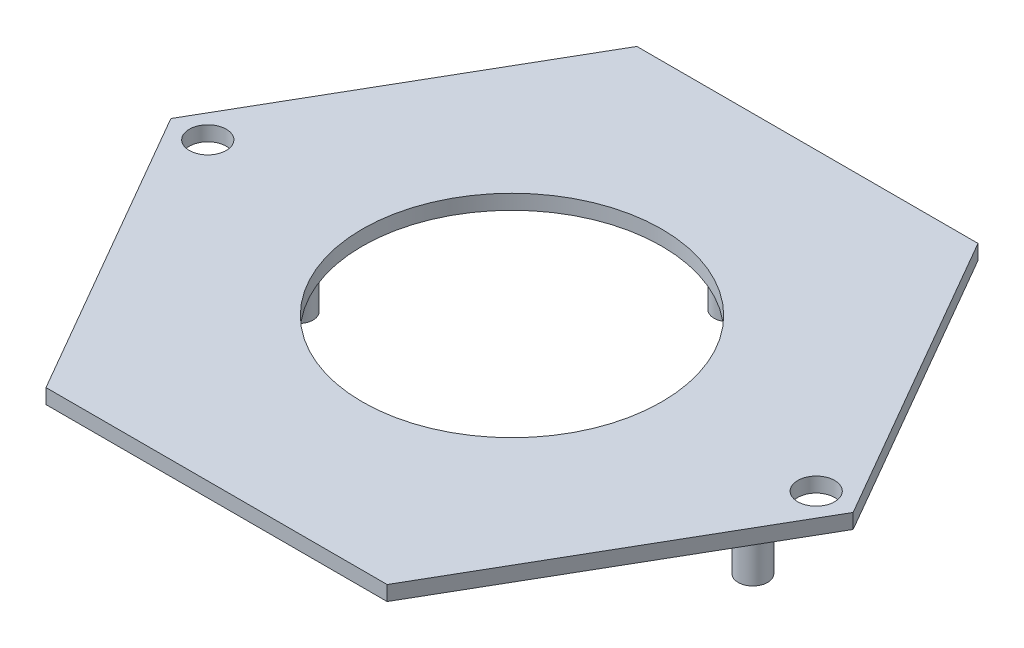
ISO-10303-21;
HEADER;
FILE_DESCRIPTION(('STEP AP214'),'2;1');
FILE_NAME('part.step','',(''),(''),'','','');
FILE_SCHEMA(('AUTOMOTIVE_DESIGN { 1 0 10303 214 1 1 1 1 }'));
ENDSEC;
DATA;
#1=APPLICATION_CONTEXT('core data for automotive mechanical design processes');
#2=APPLICATION_PROTOCOL_DEFINITION('international standard','automotive_design',2000,#1);
#3=PRODUCT_CONTEXT('',#1,'mechanical');
#4=PRODUCT('Part','Part','',(#3));
#5=PRODUCT_RELATED_PRODUCT_CATEGORY('part','',(#4));
#6=PRODUCT_DEFINITION_FORMATION('','',#4);
#7=PRODUCT_DEFINITION_CONTEXT('part definition',#1,'design');
#8=PRODUCT_DEFINITION('design','',#6,#7);
#9=PRODUCT_DEFINITION_SHAPE('','',#8);
#10=(LENGTH_UNIT() NAMED_UNIT(*) SI_UNIT(.MILLI.,.METRE.));
#11=(NAMED_UNIT(*) PLANE_ANGLE_UNIT() SI_UNIT($,.RADIAN.));
#12=(NAMED_UNIT(*) SI_UNIT($,.STERADIAN.) SOLID_ANGLE_UNIT());
#13=UNCERTAINTY_MEASURE_WITH_UNIT(LENGTH_MEASURE(1.E-05),#10,'distance_accuracy_value','');
#14=(GEOMETRIC_REPRESENTATION_CONTEXT(3) GLOBAL_UNCERTAINTY_ASSIGNED_CONTEXT((#13)) GLOBAL_UNIT_ASSIGNED_CONTEXT((#10,
#11,#12)) REPRESENTATION_CONTEXT('',''));
#15=CARTESIAN_POINT('',(0.,0.,0.));
#16=DIRECTION('',(0.,0.,1.));
#17=DIRECTION('',(1.,0.,0.));
#18=AXIS2_PLACEMENT_3D('',#15,#16,#17);
#19=CARTESIAN_POINT('',(11.5470053837928,1.,19.9999999999999));
#20=DIRECTION('',(-0.866025403784441,0.,-0.499999999999995));
#21=DIRECTION('',(-0.499999999999995,0.,0.866025403784442));
#22=AXIS2_PLACEMENT_3D('',#19,#20,#21);
#23=PLANE('',#22);
#24=DIRECTION('',(0.499999999999995,0.,-0.866025403784441));
#25=VECTOR('',#24,1.);
#26=CARTESIAN_POINT('',(11.5470053837928,0.,19.9999999999999));
#27=LINE('',#26,#25);
#28=CARTESIAN_POINT('',(11.5470053837928,0.,19.9999999999999));
#29=VERTEX_POINT('',#28);
#30=CARTESIAN_POINT('',(23.0940107675851,0.,0.));
#31=VERTEX_POINT('',#30);
#32=EDGE_CURVE('E119',#29,#31,#27,.T.);
#33=ORIENTED_EDGE('',*,*,#32,.T.);
#34=DIRECTION('',(0.,-1.,0.));
#35=VECTOR('',#34,1.);
#36=CARTESIAN_POINT('',(23.0940107675851,1.,0.));
#37=LINE('',#36,#35);
#38=CARTESIAN_POINT('',(23.0940107675851,1.,0.));
#39=VERTEX_POINT('',#38);
#40=EDGE_CURVE('E137',#39,#31,#37,.T.);
#41=ORIENTED_EDGE('',*,*,#40,.F.);
#42=DIRECTION('',(0.499999999999995,0.,-0.866025403784441));
#43=VECTOR('',#42,1.);
#44=CARTESIAN_POINT('',(11.5470053837928,1.,19.9999999999999));
#45=LINE('',#44,#43);
#46=CARTESIAN_POINT('',(11.5470053837928,1.,19.9999999999999));
#47=VERTEX_POINT('',#46);
#48=EDGE_CURVE('E130',#47,#39,#45,.T.);
#49=ORIENTED_EDGE('',*,*,#48,.F.);
#50=DIRECTION('',(0.,-1.,0.));
#51=VECTOR('',#50,1.);
#52=CARTESIAN_POINT('',(11.5470053837928,1.,19.9999999999999));
#53=LINE('',#52,#51);
#54=EDGE_CURVE('E115',#47,#29,#53,.T.);
#55=ORIENTED_EDGE('',*,*,#54,.T.);
#56=EDGE_LOOP('',(#33,#41,#49,#55));
#57=FACE_BOUND('',#56,.T.);
#58=ADVANCED_FACE('F32',(#57),#23,.F.);
#59=CARTESIAN_POINT('',(23.0940107675851,1.,0.));
#60=DIRECTION('',(-0.866025403784438,0.,0.500000000000001));
#61=DIRECTION('',(0.500000000000001,0.,0.866025403784438));
#62=AXIS2_PLACEMENT_3D('',#59,#60,#61);
#63=PLANE('',#62);
#64=DIRECTION('',(-0.500000000000001,0.,-0.866025403784438));
#65=VECTOR('',#64,1.);
#66=CARTESIAN_POINT('',(23.0940107675851,0.,0.));
#67=LINE('',#66,#65);
#68=CARTESIAN_POINT('',(11.5470053837925,0.,-20.));
#69=VERTEX_POINT('',#68);
#70=EDGE_CURVE('E122',#31,#69,#67,.T.);
#71=ORIENTED_EDGE('',*,*,#70,.T.);
#72=DIRECTION('',(0.,-1.,0.));
#73=VECTOR('',#72,1.);
#74=CARTESIAN_POINT('',(11.5470053837925,1.,-20.));
#75=LINE('',#74,#73);
#76=CARTESIAN_POINT('',(11.5470053837925,1.,-20.));
#77=VERTEX_POINT('',#76);
#78=EDGE_CURVE('E134',#77,#69,#75,.T.);
#79=ORIENTED_EDGE('',*,*,#78,.F.);
#80=DIRECTION('',(-0.500000000000001,0.,-0.866025403784438));
#81=VECTOR('',#80,1.);
#82=CARTESIAN_POINT('',(23.0940107675851,1.,0.));
#83=LINE('',#82,#81);
#84=EDGE_CURVE('E88',#39,#77,#83,.T.);
#85=ORIENTED_EDGE('',*,*,#84,.F.);
#86=ORIENTED_EDGE('',*,*,#40,.T.);
#87=EDGE_LOOP('',(#71,#79,#85,#86));
#88=FACE_BOUND('',#87,.T.);
#89=ADVANCED_FACE('F174',(#88),#63,.F.);
#90=CARTESIAN_POINT('',(11.5470053837925,1.,-20.));
#91=DIRECTION('',(0.,0.,1.));
#92=DIRECTION('',(1.,0.,0.));
#93=AXIS2_PLACEMENT_3D('',#90,#91,#92);
#94=PLANE('',#93);
#95=DIRECTION('',(-1.,0.,0.));
#96=VECTOR('',#95,1.);
#97=CARTESIAN_POINT('',(11.5470053837925,0.,-20.));
#98=LINE('',#97,#96);
#99=CARTESIAN_POINT('',(-11.5470053837926,0.,-20.));
#100=VERTEX_POINT('',#99);
#101=EDGE_CURVE('E125',#69,#100,#98,.T.);
#102=ORIENTED_EDGE('',*,*,#101,.T.);
#103=DIRECTION('',(0.,-1.,0.));
#104=VECTOR('',#103,1.);
#105=CARTESIAN_POINT('',(-11.5470053837926,1.,-20.));
#106=LINE('',#105,#104);
#107=CARTESIAN_POINT('',(-11.5470053837926,1.,-20.));
#108=VERTEX_POINT('',#107);
#109=EDGE_CURVE('E110',#108,#100,#106,.T.);
#110=ORIENTED_EDGE('',*,*,#109,.F.);
#111=DIRECTION('',(-1.,0.,0.));
#112=VECTOR('',#111,1.);
#113=CARTESIAN_POINT('',(11.5470053837925,1.,-20.));
#114=LINE('',#113,#112);
#115=EDGE_CURVE('E101',#77,#108,#114,.T.);
#116=ORIENTED_EDGE('',*,*,#115,.F.);
#117=ORIENTED_EDGE('',*,*,#78,.T.);
#118=EDGE_LOOP('',(#102,#110,#116,#117));
#119=FACE_BOUND('',#118,.T.);
#120=ADVANCED_FACE('F177',(#119),#94,.F.);
#121=CARTESIAN_POINT('',(-11.5470053837926,1.,-20.));
#122=DIRECTION('',(0.866025403784442,0.,0.499999999999995));
#123=DIRECTION('',(0.499999999999995,0.,-0.866025403784442));
#124=AXIS2_PLACEMENT_3D('',#121,#122,#123);
#125=PLANE('',#124);
#126=DIRECTION('',(-0.499999999999995,0.,0.866025403784442));
#127=VECTOR('',#126,1.);
#128=CARTESIAN_POINT('',(-11.5470053837926,0.,-20.));
#129=LINE('',#128,#127);
#130=CARTESIAN_POINT('',(-23.0940107675851,0.,1.61264615268131E-13));
#131=VERTEX_POINT('',#130);
#132=EDGE_CURVE('E109',#100,#131,#129,.T.);
#133=ORIENTED_EDGE('',*,*,#132,.T.);
#134=DIRECTION('',(0.,-1.,0.));
#135=VECTOR('',#134,1.);
#136=CARTESIAN_POINT('',(-23.0940107675851,1.,1.61264615268131E-13));
#137=LINE('',#136,#135);
#138=CARTESIAN_POINT('',(-23.0940107675851,1.,1.61264615268131E-13));
#139=VERTEX_POINT('',#138);
#140=EDGE_CURVE('E106',#139,#131,#137,.T.);
#141=ORIENTED_EDGE('',*,*,#140,.F.);
#142=DIRECTION('',(-0.499999999999995,0.,0.866025403784442));
#143=VECTOR('',#142,1.);
#144=CARTESIAN_POINT('',(-11.5470053837926,1.,-20.));
#145=LINE('',#144,#143);
#146=EDGE_CURVE('E95',#108,#139,#145,.T.);
#147=ORIENTED_EDGE('',*,*,#146,.F.);
#148=ORIENTED_EDGE('',*,*,#109,.T.);
#149=EDGE_LOOP('',(#133,#141,#147,#148));
#150=FACE_BOUND('',#149,.T.);
#151=ADVANCED_FACE('F107',(#150),#125,.F.);
#152=CARTESIAN_POINT('',(-23.0940107675851,1.,1.61264615268131E-13));
#153=DIRECTION('',(0.866025403784435,0.,-0.500000000000007));
#154=DIRECTION('',(-0.500000000000007,0.,-0.866025403784435));
#155=AXIS2_PLACEMENT_3D('',#152,#153,#154);
#156=PLANE('',#155);
#157=DIRECTION('',(0.500000000000007,0.,0.866025403784435));
#158=VECTOR('',#157,1.);
#159=CARTESIAN_POINT('',(-23.0940107675851,0.,1.61264615268131E-13));
#160=LINE('',#159,#158);
#161=CARTESIAN_POINT('',(-11.5470053837923,0.,20.0000000000001));
#162=VERTEX_POINT('',#161);
#163=EDGE_CURVE('E73',#131,#162,#160,.T.);
#164=ORIENTED_EDGE('',*,*,#163,.T.);
#165=DIRECTION('',(0.,-1.,0.));
#166=VECTOR('',#165,1.);
#167=CARTESIAN_POINT('',(-11.5470053837923,1.,20.0000000000001));
#168=LINE('',#167,#166);
#169=CARTESIAN_POINT('',(-11.5470053837923,1.,20.0000000000001));
#170=VERTEX_POINT('',#169);
#171=EDGE_CURVE('E111',#170,#162,#168,.T.);
#172=ORIENTED_EDGE('',*,*,#171,.F.);
#173=DIRECTION('',(0.500000000000007,0.,0.866025403784435));
#174=VECTOR('',#173,1.);
#175=CARTESIAN_POINT('',(-23.0940107675851,1.,1.61264615268131E-13));
#176=LINE('',#175,#174);
#177=EDGE_CURVE('E99',#139,#170,#176,.T.);
#178=ORIENTED_EDGE('',*,*,#177,.F.);
#179=ORIENTED_EDGE('',*,*,#140,.T.);
#180=EDGE_LOOP('',(#164,#172,#178,#179));
#181=FACE_BOUND('',#180,.T.);
#182=ADVANCED_FACE('F113',(#181),#156,.F.);
#183=CARTESIAN_POINT('',(-11.5470053837923,1.,20.0000000000001));
#184=DIRECTION('',(0.,0.,-1.));
#185=DIRECTION('',(-1.,0.,0.));
#186=AXIS2_PLACEMENT_3D('',#183,#184,#185);
#187=PLANE('',#186);
#188=DIRECTION('',(1.,0.,0.));
#189=VECTOR('',#188,1.);
#190=CARTESIAN_POINT('',(-11.5470053837923,0.,20.0000000000001));
#191=LINE('',#190,#189);
#192=EDGE_CURVE('E79',#162,#29,#191,.T.);
#193=ORIENTED_EDGE('',*,*,#192,.T.);
#194=ORIENTED_EDGE('',*,*,#54,.F.);
#195=DIRECTION('',(1.,0.,0.));
#196=VECTOR('',#195,1.);
#197=CARTESIAN_POINT('',(-11.5470053837923,1.,20.0000000000001));
#198=LINE('',#197,#196);
#199=EDGE_CURVE('E50',#170,#47,#198,.T.);
#200=ORIENTED_EDGE('',*,*,#199,.F.);
#201=ORIENTED_EDGE('',*,*,#171,.T.);
#202=EDGE_LOOP('',(#193,#194,#200,#201));
#203=FACE_BOUND('',#202,.T.);
#204=ADVANCED_FACE('F182',(#203),#187,.F.);
#205=CARTESIAN_POINT('',(0.,1.,0.));
#206=DIRECTION('',(0.,1.,0.));
#207=DIRECTION('',(0.,0.,1.));
#208=AXIS2_PLACEMENT_3D('',#205,#206,#207);
#209=PLANE('',#208);
#210=CARTESIAN_POINT('',(20.5940107675851,1.,0.));
#211=DIRECTION('',(0.,1.,0.));
#212=DIRECTION('',(0.,0.,1.));
#213=AXIS2_PLACEMENT_3D('',#210,#211,#212);
#214=CIRCLE('',#213,1.25);
#215=CARTESIAN_POINT('',(20.5940107675851,1.,1.25000000000007));
#216=VERTEX_POINT('',#215);
#217=EDGE_CURVE('E150',#216,#216,#214,.T.);
#218=ORIENTED_EDGE('',*,*,#217,.F.);
#219=EDGE_LOOP('',(#218));
#220=FACE_BOUND('',#219,.T.);
#221=CARTESIAN_POINT('',(-20.594010767585,1.,0.));
#222=DIRECTION('',(0.,1.,0.));
#223=DIRECTION('',(0.,0.,1.));
#224=AXIS2_PLACEMENT_3D('',#221,#222,#223);
#225=CIRCLE('',#224,1.25);
#226=CARTESIAN_POINT('',(-20.594010767585,1.,1.25000000000007));
#227=VERTEX_POINT('',#226);
#228=EDGE_CURVE('E155',#227,#227,#225,.T.);
#229=ORIENTED_EDGE('',*,*,#228,.F.);
#230=EDGE_LOOP('',(#229));
#231=FACE_BOUND('',#230,.T.);
#232=CARTESIAN_POINT('',(0.,1.,0.));
#233=DIRECTION('',(0.,1.,0.));
#234=DIRECTION('',(0.,0.,1.));
#235=AXIS2_PLACEMENT_3D('',#232,#233,#234);
#236=CIRCLE('',#235,10.1352671645119);
#237=CARTESIAN_POINT('',(0.,1.,10.1352671645119));
#238=VERTEX_POINT('',#237);
#239=EDGE_CURVE('E147',#238,#238,#236,.T.);
#240=ORIENTED_EDGE('',*,*,#239,.F.);
#241=EDGE_LOOP('',(#240));
#242=FACE_BOUND('',#241,.T.);
#243=ORIENTED_EDGE('',*,*,#48,.T.);
#244=ORIENTED_EDGE('',*,*,#84,.T.);
#245=ORIENTED_EDGE('',*,*,#115,.T.);
#246=ORIENTED_EDGE('',*,*,#146,.T.);
#247=ORIENTED_EDGE('',*,*,#177,.T.);
#248=ORIENTED_EDGE('',*,*,#199,.T.);
#249=EDGE_LOOP('',(#243,#244,#245,#246,#247,#248));
#250=FACE_BOUND('',#249,.T.);
#251=ADVANCED_FACE('F97',(#220,#231,#242,#250),#209,.T.);
#252=CARTESIAN_POINT('',(0.,0.,0.));
#253=DIRECTION('',(0.,1.,0.));
#254=DIRECTION('',(0.,0.,1.));
#255=AXIS2_PLACEMENT_3D('',#252,#253,#254);
#256=PLANE('',#255);
#257=CARTESIAN_POINT('',(20.5940107675851,0.,0.));
#258=DIRECTION('',(0.,1.,0.));
#259=DIRECTION('',(0.,0.,1.));
#260=AXIS2_PLACEMENT_3D('',#257,#258,#259);
#261=CIRCLE('',#260,1.25);
#262=CARTESIAN_POINT('',(20.5940107675851,0.,1.25000000000007));
#263=VERTEX_POINT('',#262);
#264=EDGE_CURVE('E35',#263,#263,#261,.T.);
#265=ORIENTED_EDGE('',*,*,#264,.T.);
#266=EDGE_LOOP('',(#265));
#267=FACE_BOUND('',#266,.T.);
#268=CARTESIAN_POINT('',(-20.594010767585,0.,0.));
#269=DIRECTION('',(0.,1.,0.));
#270=DIRECTION('',(0.,0.,1.));
#271=AXIS2_PLACEMENT_3D('',#268,#269,#270);
#272=CIRCLE('',#271,1.25);
#273=CARTESIAN_POINT('',(-20.594010767585,0.,1.25000000000007));
#274=VERTEX_POINT('',#273);
#275=EDGE_CURVE('E148',#274,#274,#272,.T.);
#276=ORIENTED_EDGE('',*,*,#275,.T.);
#277=EDGE_LOOP('',(#276));
#278=FACE_BOUND('',#277,.T.);
#279=CARTESIAN_POINT('',(0.,0.,0.));
#280=DIRECTION('',(0.,1.,0.));
#281=DIRECTION('',(0.,0.,1.));
#282=AXIS2_PLACEMENT_3D('',#279,#280,#281);
#283=CIRCLE('',#282,10.1352671645119);
#284=CARTESIAN_POINT('',(0.,0.,10.1352671645119));
#285=VERTEX_POINT('',#284);
#286=EDGE_CURVE('E144',#285,#285,#283,.T.);
#287=ORIENTED_EDGE('',*,*,#286,.T.);
#288=EDGE_LOOP('',(#287));
#289=FACE_BOUND('',#288,.T.);
#290=CARTESIAN_POINT('',(0.,0.,-14.6750009661952));
#291=DIRECTION('',(0.,1.,0.));
#292=DIRECTION('',(0.,0.,1.));
#293=AXIS2_PLACEMENT_3D('',#290,#291,#292);
#294=CIRCLE('',#293,1.);
#295=CARTESIAN_POINT('',(0.,0.,-13.6750009661952));
#296=VERTEX_POINT('',#295);
#297=EDGE_CURVE('E11',#296,#296,#294,.F.);
#298=ORIENTED_EDGE('',*,*,#297,.F.);
#299=EDGE_LOOP('',(#298));
#300=FACE_BOUND('',#299,.T.);
#301=CARTESIAN_POINT('',(-14.4622148451923,0.,0.));
#302=DIRECTION('',(0.,1.,0.));
#303=DIRECTION('',(0.,0.,1.));
#304=AXIS2_PLACEMENT_3D('',#301,#302,#303);
#305=CIRCLE('',#304,1.);
#306=CARTESIAN_POINT('',(-14.4622148451923,0.,1.));
#307=VERTEX_POINT('',#306);
#308=EDGE_CURVE('E41',#307,#307,#305,.F.);
#309=ORIENTED_EDGE('',*,*,#308,.F.);
#310=EDGE_LOOP('',(#309));
#311=FACE_BOUND('',#310,.T.);
#312=CARTESIAN_POINT('',(16.3081635651831,0.,0.));
#313=DIRECTION('',(0.,1.,0.));
#314=DIRECTION('',(0.,0.,1.));
#315=AXIS2_PLACEMENT_3D('',#312,#313,#314);
#316=CIRCLE('',#315,1.);
#317=CARTESIAN_POINT('',(16.3081635651831,0.,1.));
#318=VERTEX_POINT('',#317);
#319=EDGE_CURVE('E139',#318,#318,#316,.F.);
#320=ORIENTED_EDGE('',*,*,#319,.F.);
#321=EDGE_LOOP('',(#320));
#322=FACE_BOUND('',#321,.T.);
#323=ORIENTED_EDGE('',*,*,#32,.F.);
#324=ORIENTED_EDGE('',*,*,#192,.F.);
#325=ORIENTED_EDGE('',*,*,#163,.F.);
#326=ORIENTED_EDGE('',*,*,#132,.F.);
#327=ORIENTED_EDGE('',*,*,#101,.F.);
#328=ORIENTED_EDGE('',*,*,#70,.F.);
#329=EDGE_LOOP('',(#323,#324,#325,#326,#327,#328));
#330=FACE_BOUND('',#329,.T.);
#331=ADVANCED_FACE('F180',(#267,#278,#289,#300,#311,#322,#330),#256,.F.);
#332=CARTESIAN_POINT('',(16.3081635651831,-6.,0.));
#333=DIRECTION('',(0.,1.,0.));
#334=DIRECTION('',(0.,0.,1.));
#335=AXIS2_PLACEMENT_3D('',#332,#333,#334);
#336=CYLINDRICAL_SURFACE('',#335,1.);
#337=CARTESIAN_POINT('',(16.3081635651831,-6.,0.));
#338=DIRECTION('',(0.,-1.,0.));
#339=DIRECTION('',(0.,0.,-1.));
#340=AXIS2_PLACEMENT_3D('',#337,#338,#339);
#341=CIRCLE('',#340,1.);
#342=CARTESIAN_POINT('',(16.3081635651831,-6.,-1.));
#343=VERTEX_POINT('',#342);
#344=EDGE_CURVE('E123',#343,#343,#341,.T.);
#345=ORIENTED_EDGE('',*,*,#344,.F.);
#346=EDGE_LOOP('',(#345));
#347=FACE_BOUND('',#346,.T.);
#348=ORIENTED_EDGE('',*,*,#319,.T.);
#349=EDGE_LOOP('',(#348));
#350=FACE_BOUND('',#349,.T.);
#351=ADVANCED_FACE('F221',(#347,#350),#336,.T.);
#352=CARTESIAN_POINT('',(16.3081635651831,-6.,0.));
#353=DIRECTION('',(0.,-1.,0.));
#354=DIRECTION('',(0.,0.,-1.));
#355=AXIS2_PLACEMENT_3D('',#352,#353,#354);
#356=PLANE('',#355);
#357=ORIENTED_EDGE('',*,*,#344,.T.);
#358=EDGE_LOOP('',(#357));
#359=FACE_BOUND('',#358,.T.);
#360=ADVANCED_FACE('F226',(#359),#356,.T.);
#361=CARTESIAN_POINT('',(-14.4622148451923,-6.,0.));
#362=DIRECTION('',(0.,1.,0.));
#363=DIRECTION('',(0.,0.,1.));
#364=AXIS2_PLACEMENT_3D('',#361,#362,#363);
#365=CYLINDRICAL_SURFACE('',#364,1.);
#366=CARTESIAN_POINT('',(-14.4622148451923,-6.,0.));
#367=DIRECTION('',(0.,-1.,0.));
#368=DIRECTION('',(0.,0.,-1.));
#369=AXIS2_PLACEMENT_3D('',#366,#367,#368);
#370=CIRCLE('',#369,1.);
#371=CARTESIAN_POINT('',(-14.4622148451923,-6.,-1.));
#372=VERTEX_POINT('',#371);
#373=EDGE_CURVE('E166',#372,#372,#370,.T.);
#374=ORIENTED_EDGE('',*,*,#373,.F.);
#375=EDGE_LOOP('',(#374));
#376=FACE_BOUND('',#375,.T.);
#377=ORIENTED_EDGE('',*,*,#308,.T.);
#378=EDGE_LOOP('',(#377));
#379=FACE_BOUND('',#378,.T.);
#380=ADVANCED_FACE('F238',(#376,#379),#365,.T.);
#381=CARTESIAN_POINT('',(-14.4622148451923,-6.,0.));
#382=DIRECTION('',(0.,-1.,0.));
#383=DIRECTION('',(0.,0.,-1.));
#384=AXIS2_PLACEMENT_3D('',#381,#382,#383);
#385=PLANE('',#384);
#386=ORIENTED_EDGE('',*,*,#373,.T.);
#387=EDGE_LOOP('',(#386));
#388=FACE_BOUND('',#387,.T.);
#389=ADVANCED_FACE('F248',(#388),#385,.T.);
#390=CARTESIAN_POINT('',(0.,-6.,-14.6750009661952));
#391=DIRECTION('',(0.,1.,0.));
#392=DIRECTION('',(0.,0.,1.));
#393=AXIS2_PLACEMENT_3D('',#390,#391,#392);
#394=CYLINDRICAL_SURFACE('',#393,1.);
#395=CARTESIAN_POINT('',(0.,-6.,-14.6750009661952));
#396=DIRECTION('',(0.,-1.,0.));
#397=DIRECTION('',(0.,0.,-1.));
#398=AXIS2_PLACEMENT_3D('',#395,#396,#397);
#399=CIRCLE('',#398,1.);
#400=CARTESIAN_POINT('',(0.,-6.,-15.6750009661952));
#401=VERTEX_POINT('',#400);
#402=EDGE_CURVE('E146',#401,#401,#399,.T.);
#403=ORIENTED_EDGE('',*,*,#402,.F.);
#404=EDGE_LOOP('',(#403));
#405=FACE_BOUND('',#404,.T.);
#406=ORIENTED_EDGE('',*,*,#297,.T.);
#407=EDGE_LOOP('',(#406));
#408=FACE_BOUND('',#407,.T.);
#409=ADVANCED_FACE('F258',(#405,#408),#394,.T.);
#410=CARTESIAN_POINT('',(0.,-6.,-14.6750009661952));
#411=DIRECTION('',(0.,-1.,0.));
#412=DIRECTION('',(0.,0.,-1.));
#413=AXIS2_PLACEMENT_3D('',#410,#411,#412);
#414=PLANE('',#413);
#415=ORIENTED_EDGE('',*,*,#402,.T.);
#416=EDGE_LOOP('',(#415));
#417=FACE_BOUND('',#416,.T.);
#418=ADVANCED_FACE('F268',(#417),#414,.T.);
#419=CARTESIAN_POINT('',(0.,-5.,0.));
#420=DIRECTION('',(0.,1.,0.));
#421=DIRECTION('',(0.,0.,1.));
#422=AXIS2_PLACEMENT_3D('',#419,#420,#421);
#423=CYLINDRICAL_SURFACE('',#422,10.1352671645119);
#424=ORIENTED_EDGE('',*,*,#239,.T.);
#425=EDGE_LOOP('',(#424));
#426=FACE_BOUND('',#425,.T.);
#427=ORIENTED_EDGE('',*,*,#286,.F.);
#428=EDGE_LOOP('',(#427));
#429=FACE_BOUND('',#428,.T.);
#430=ADVANCED_FACE('F278',(#426,#429),#423,.F.);
#431=CARTESIAN_POINT('',(-20.594010767585,-14.,0.));
#432=DIRECTION('',(0.,1.,0.));
#433=DIRECTION('',(0.,0.,1.));
#434=AXIS2_PLACEMENT_3D('',#431,#432,#433);
#435=CYLINDRICAL_SURFACE('',#434,1.25);
#436=ORIENTED_EDGE('',*,*,#228,.T.);
#437=EDGE_LOOP('',(#436));
#438=FACE_BOUND('',#437,.T.);
#439=ORIENTED_EDGE('',*,*,#275,.F.);
#440=EDGE_LOOP('',(#439));
#441=FACE_BOUND('',#440,.T.);
#442=ADVANCED_FACE('F288',(#438,#441),#435,.F.);
#443=CARTESIAN_POINT('',(20.5940107675851,-14.,0.));
#444=DIRECTION('',(0.,1.,0.));
#445=DIRECTION('',(0.,0.,1.));
#446=AXIS2_PLACEMENT_3D('',#443,#444,#445);
#447=CYLINDRICAL_SURFACE('',#446,1.25);
#448=ORIENTED_EDGE('',*,*,#217,.T.);
#449=EDGE_LOOP('',(#448));
#450=FACE_BOUND('',#449,.T.);
#451=ORIENTED_EDGE('',*,*,#264,.F.);
#452=EDGE_LOOP('',(#451));
#453=FACE_BOUND('',#452,.T.);
#454=ADVANCED_FACE('F309',(#450,#453),#447,.F.);
#455=CLOSED_SHELL('',(#58,#89,#120,#151,#182,#204,#251,#331,#351,#360,#380,#389,#409,#418,#430,
#442,#454));
#456=MANIFOLD_SOLID_BREP('B2',#455);
#457=ADVANCED_BREP_SHAPE_REPRESENTATION('',(#18,#456),#14);
#458=SHAPE_DEFINITION_REPRESENTATION(#9,#457);
ENDSEC;
END-ISO-10303-21;
